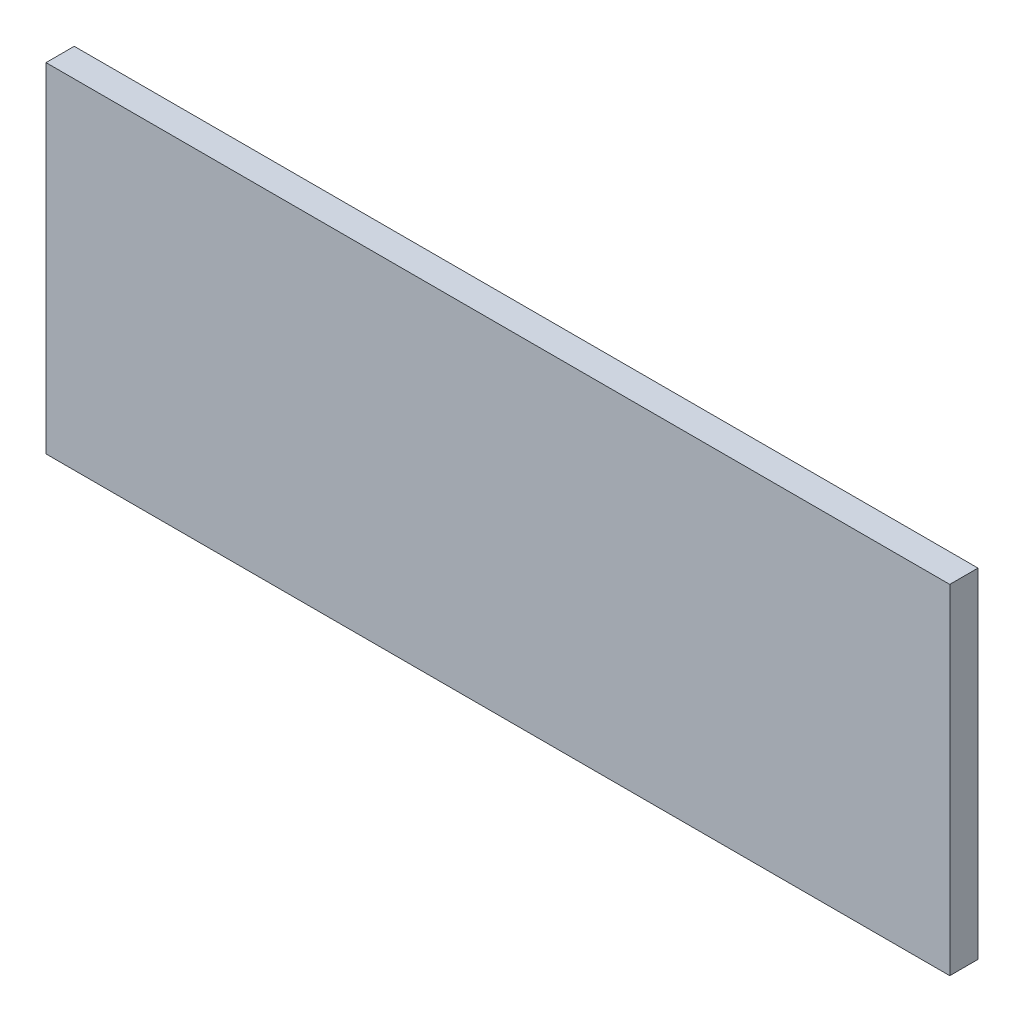
ISO-10303-21;
HEADER;
FILE_DESCRIPTION(('STEP AP214'),'2;1');
FILE_NAME('part.step','',(''),(''),'','','');
FILE_SCHEMA(('AUTOMOTIVE_DESIGN { 1 0 10303 214 1 1 1 1 }'));
ENDSEC;
DATA;
#1=APPLICATION_CONTEXT('core data for automotive mechanical design processes');
#2=APPLICATION_PROTOCOL_DEFINITION('international standard','automotive_design',2000,#1);
#3=PRODUCT_CONTEXT('',#1,'mechanical');
#4=PRODUCT('Part','Part','',(#3));
#5=PRODUCT_RELATED_PRODUCT_CATEGORY('part','',(#4));
#6=PRODUCT_DEFINITION_FORMATION('','',#4);
#7=PRODUCT_DEFINITION_CONTEXT('part definition',#1,'design');
#8=PRODUCT_DEFINITION('design','',#6,#7);
#9=PRODUCT_DEFINITION_SHAPE('','',#8);
#10=(LENGTH_UNIT() NAMED_UNIT(*) SI_UNIT(.MILLI.,.METRE.));
#11=(NAMED_UNIT(*) PLANE_ANGLE_UNIT() SI_UNIT($,.RADIAN.));
#12=(NAMED_UNIT(*) SI_UNIT($,.STERADIAN.) SOLID_ANGLE_UNIT());
#13=UNCERTAINTY_MEASURE_WITH_UNIT(LENGTH_MEASURE(1.E-05),#10,'distance_accuracy_value','');
#14=(GEOMETRIC_REPRESENTATION_CONTEXT(3) GLOBAL_UNCERTAINTY_ASSIGNED_CONTEXT((#13)) GLOBAL_UNIT_ASSIGNED_CONTEXT((#10,
#11,#12)) REPRESENTATION_CONTEXT('',''));
#15=CARTESIAN_POINT('',(0.,0.,0.));
#16=DIRECTION('',(0.,0.,1.));
#17=DIRECTION('',(1.,0.,0.));
#18=AXIS2_PLACEMENT_3D('',#15,#16,#17);
#19=CARTESIAN_POINT('',(0.,0.,19.05));
#20=DIRECTION('',(1.,0.,0.));
#21=DIRECTION('',(0.,1.,0.));
#22=AXIS2_PLACEMENT_3D('',#19,#20,#21);
#23=PLANE('',#22);
#24=DIRECTION('',(0.,-1.,0.));
#25=VECTOR('',#24,1.);
#26=CARTESIAN_POINT('',(0.,0.,0.));
#27=LINE('',#26,#25);
#28=CARTESIAN_POINT('',(0.,0.,0.));
#29=VERTEX_POINT('',#28);
#30=CARTESIAN_POINT('',(0.,-228.6,0.));
#31=VERTEX_POINT('',#30);
#32=EDGE_CURVE('E98',#29,#31,#27,.T.);
#33=ORIENTED_EDGE('',*,*,#32,.T.);
#34=DIRECTION('',(0.,0.,-1.));
#35=VECTOR('',#34,1.);
#36=CARTESIAN_POINT('',(0.,-228.6,19.05));
#37=LINE('',#36,#35);
#38=CARTESIAN_POINT('',(0.,-228.6,19.05));
#39=VERTEX_POINT('',#38);
#40=EDGE_CURVE('E11',#39,#31,#37,.T.);
#41=ORIENTED_EDGE('',*,*,#40,.F.);
#42=DIRECTION('',(0.,-1.,0.));
#43=VECTOR('',#42,1.);
#44=CARTESIAN_POINT('',(0.,0.,19.05));
#45=LINE('',#44,#43);
#46=CARTESIAN_POINT('',(0.,0.,19.05));
#47=VERTEX_POINT('',#46);
#48=EDGE_CURVE('E86',#47,#39,#45,.T.);
#49=ORIENTED_EDGE('',*,*,#48,.F.);
#50=DIRECTION('',(0.,0.,-1.));
#51=VECTOR('',#50,1.);
#52=CARTESIAN_POINT('',(0.,0.,19.05));
#53=LINE('',#52,#51);
#54=EDGE_CURVE('E94',#47,#29,#53,.T.);
#55=ORIENTED_EDGE('',*,*,#54,.T.);
#56=EDGE_LOOP('',(#33,#41,#49,#55));
#57=FACE_BOUND('',#56,.T.);
#58=ADVANCED_FACE('F35',(#57),#23,.F.);
#59=CARTESIAN_POINT('',(0.,-228.6,19.05));
#60=DIRECTION('',(0.,1.,0.));
#61=DIRECTION('',(0.,0.,1.));
#62=AXIS2_PLACEMENT_3D('',#59,#60,#61);
#63=PLANE('',#62);
#64=DIRECTION('',(1.,0.,0.));
#65=VECTOR('',#64,1.);
#66=CARTESIAN_POINT('',(0.,-228.6,0.));
#67=LINE('',#66,#65);
#68=CARTESIAN_POINT('',(609.6,-228.6,0.));
#69=VERTEX_POINT('',#68);
#70=EDGE_CURVE('E90',#31,#69,#67,.T.);
#71=ORIENTED_EDGE('',*,*,#70,.T.);
#72=DIRECTION('',(0.,0.,-1.));
#73=VECTOR('',#72,1.);
#74=CARTESIAN_POINT('',(609.6,-228.6,19.05));
#75=LINE('',#74,#73);
#76=CARTESIAN_POINT('',(609.6,-228.6,19.05));
#77=VERTEX_POINT('',#76);
#78=EDGE_CURVE('E43',#77,#69,#75,.T.);
#79=ORIENTED_EDGE('',*,*,#78,.F.);
#80=DIRECTION('',(1.,0.,0.));
#81=VECTOR('',#80,1.);
#82=CARTESIAN_POINT('',(0.,-228.6,19.05));
#83=LINE('',#82,#81);
#84=EDGE_CURVE('E81',#39,#77,#83,.T.);
#85=ORIENTED_EDGE('',*,*,#84,.F.);
#86=ORIENTED_EDGE('',*,*,#40,.T.);
#87=EDGE_LOOP('',(#71,#79,#85,#86));
#88=FACE_BOUND('',#87,.T.);
#89=ADVANCED_FACE('F89',(#88),#63,.F.);
#90=CARTESIAN_POINT('',(609.6,0.,19.05));
#91=DIRECTION('',(-1.,0.,0.));
#92=DIRECTION('',(0.,0.,1.));
#93=AXIS2_PLACEMENT_3D('',#90,#91,#92);
#94=PLANE('',#93);
#95=DIRECTION('',(0.,1.,0.));
#96=VECTOR('',#95,1.);
#97=CARTESIAN_POINT('',(609.6,0.,0.));
#98=LINE('',#97,#96);
#99=CARTESIAN_POINT('',(609.6,0.,0.));
#100=VERTEX_POINT('',#99);
#101=EDGE_CURVE('E68',#69,#100,#98,.T.);
#102=ORIENTED_EDGE('',*,*,#101,.T.);
#103=DIRECTION('',(0.,0.,-1.));
#104=VECTOR('',#103,1.);
#105=CARTESIAN_POINT('',(609.6,0.,19.05));
#106=LINE('',#105,#104);
#107=CARTESIAN_POINT('',(609.6,0.,19.05));
#108=VERTEX_POINT('',#107);
#109=EDGE_CURVE('E91',#108,#100,#106,.T.);
#110=ORIENTED_EDGE('',*,*,#109,.F.);
#111=DIRECTION('',(0.,1.,0.));
#112=VECTOR('',#111,1.);
#113=CARTESIAN_POINT('',(609.6,0.,19.05));
#114=LINE('',#113,#112);
#115=EDGE_CURVE('E84',#77,#108,#114,.T.);
#116=ORIENTED_EDGE('',*,*,#115,.F.);
#117=ORIENTED_EDGE('',*,*,#78,.T.);
#118=EDGE_LOOP('',(#102,#110,#116,#117));
#119=FACE_BOUND('',#118,.T.);
#120=ADVANCED_FACE('F92',(#119),#94,.F.);
#121=CARTESIAN_POINT('',(0.,0.,19.05));
#122=DIRECTION('',(0.,-1.,0.));
#123=DIRECTION('',(0.,0.,-1.));
#124=AXIS2_PLACEMENT_3D('',#121,#122,#123);
#125=PLANE('',#124);
#126=DIRECTION('',(-1.,0.,0.));
#127=VECTOR('',#126,1.);
#128=CARTESIAN_POINT('',(0.,0.,0.));
#129=LINE('',#128,#127);
#130=EDGE_CURVE('E74',#100,#29,#129,.T.);
#131=ORIENTED_EDGE('',*,*,#130,.T.);
#132=ORIENTED_EDGE('',*,*,#54,.F.);
#133=DIRECTION('',(-1.,0.,0.));
#134=VECTOR('',#133,1.);
#135=CARTESIAN_POINT('',(0.,0.,19.05));
#136=LINE('',#135,#134);
#137=EDGE_CURVE('E51',#108,#47,#136,.T.);
#138=ORIENTED_EDGE('',*,*,#137,.F.);
#139=ORIENTED_EDGE('',*,*,#109,.T.);
#140=EDGE_LOOP('',(#131,#132,#138,#139));
#141=FACE_BOUND('',#140,.T.);
#142=ADVANCED_FACE('F105',(#141),#125,.F.);
#143=CARTESIAN_POINT('',(0.,-228.6,19.05));
#144=DIRECTION('',(0.,0.,1.));
#145=DIRECTION('',(1.,0.,0.));
#146=AXIS2_PLACEMENT_3D('',#143,#144,#145);
#147=PLANE('',#146);
#148=ORIENTED_EDGE('',*,*,#48,.T.);
#149=ORIENTED_EDGE('',*,*,#84,.T.);
#150=ORIENTED_EDGE('',*,*,#115,.T.);
#151=ORIENTED_EDGE('',*,*,#137,.T.);
#152=EDGE_LOOP('',(#148,#149,#150,#151));
#153=FACE_BOUND('',#152,.T.);
#154=ADVANCED_FACE('F82',(#153),#147,.T.);
#155=CARTESIAN_POINT('',(0.,-228.6,0.));
#156=DIRECTION('',(0.,0.,1.));
#157=DIRECTION('',(1.,0.,0.));
#158=AXIS2_PLACEMENT_3D('',#155,#156,#157);
#159=PLANE('',#158);
#160=ORIENTED_EDGE('',*,*,#32,.F.);
#161=ORIENTED_EDGE('',*,*,#130,.F.);
#162=ORIENTED_EDGE('',*,*,#101,.F.);
#163=ORIENTED_EDGE('',*,*,#70,.F.);
#164=EDGE_LOOP('',(#160,#161,#162,#163));
#165=FACE_BOUND('',#164,.T.);
#166=ADVANCED_FACE('F108',(#165),#159,.F.);
#167=CLOSED_SHELL('',(#58,#89,#120,#142,#154,#166));
#168=MANIFOLD_SOLID_BREP('B2',#167);
#169=ADVANCED_BREP_SHAPE_REPRESENTATION('',(#18,#168),#14);
#170=SHAPE_DEFINITION_REPRESENTATION(#9,#169);
ENDSEC;
END-ISO-10303-21;
